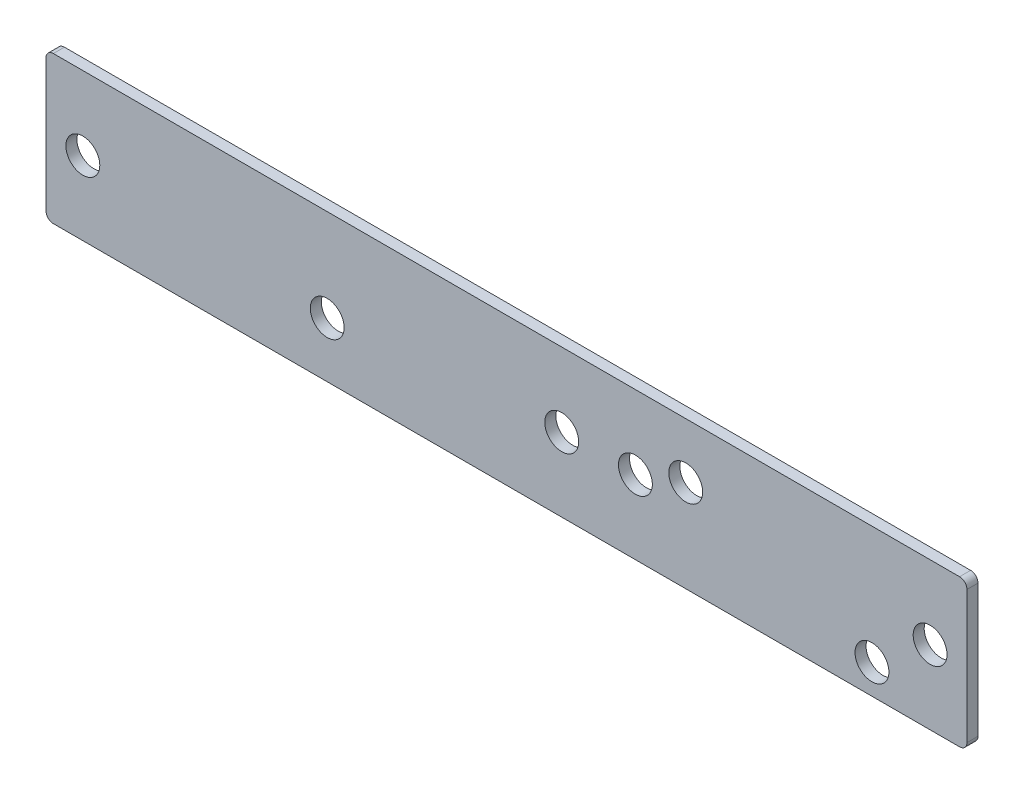
ISO-10303-21;
HEADER;
FILE_DESCRIPTION(('STEP AP214'),'2;1');
FILE_NAME('part.step','',(''),(''),'','','');
FILE_SCHEMA(('AUTOMOTIVE_DESIGN { 1 0 10303 214 1 1 1 1 }'));
ENDSEC;
DATA;
#1=APPLICATION_CONTEXT('core data for automotive mechanical design processes');
#2=APPLICATION_PROTOCOL_DEFINITION('international standard','automotive_design',2000,#1);
#3=PRODUCT_CONTEXT('',#1,'mechanical');
#4=PRODUCT('Part','Part','',(#3));
#5=PRODUCT_RELATED_PRODUCT_CATEGORY('part','',(#4));
#6=PRODUCT_DEFINITION_FORMATION('','',#4);
#7=PRODUCT_DEFINITION_CONTEXT('part definition',#1,'design');
#8=PRODUCT_DEFINITION('design','',#6,#7);
#9=PRODUCT_DEFINITION_SHAPE('','',#8);
#10=(LENGTH_UNIT() NAMED_UNIT(*) SI_UNIT(.MILLI.,.METRE.));
#11=(NAMED_UNIT(*) PLANE_ANGLE_UNIT() SI_UNIT($,.RADIAN.));
#12=(NAMED_UNIT(*) SI_UNIT($,.STERADIAN.) SOLID_ANGLE_UNIT());
#13=UNCERTAINTY_MEASURE_WITH_UNIT(LENGTH_MEASURE(1.E-05),#10,'distance_accuracy_value','');
#14=(GEOMETRIC_REPRESENTATION_CONTEXT(3) GLOBAL_UNCERTAINTY_ASSIGNED_CONTEXT((#13)) GLOBAL_UNIT_ASSIGNED_CONTEXT((#10,
#11,#12)) REPRESENTATION_CONTEXT('',''));
#15=CARTESIAN_POINT('',(0.,0.,0.));
#16=DIRECTION('',(0.,0.,1.));
#17=DIRECTION('',(1.,0.,0.));
#18=AXIS2_PLACEMENT_3D('',#15,#16,#17);
#19=CARTESIAN_POINT('',(-125.,20.,3.));
#20=DIRECTION('',(1.,0.,0.));
#21=DIRECTION('',(0.,1.,0.));
#22=AXIS2_PLACEMENT_3D('',#19,#20,#21);
#23=PLANE('',#22);
#24=DIRECTION('',(0.,-1.,0.));
#25=VECTOR('',#24,1.);
#26=CARTESIAN_POINT('',(-125.,20.,0.));
#27=LINE('',#26,#25);
#28=CARTESIAN_POINT('',(-125.,18.,0.));
#29=VERTEX_POINT('',#28);
#30=CARTESIAN_POINT('',(-125.,-18.,0.));
#31=VERTEX_POINT('',#30);
#32=EDGE_CURVE('E113',#29,#31,#27,.T.);
#33=ORIENTED_EDGE('',*,*,#32,.T.);
#34=DIRECTION('',(0.,0.,-1.));
#35=VECTOR('',#34,1.);
#36=CARTESIAN_POINT('',(-125.,-18.,3.));
#37=LINE('',#36,#35);
#38=CARTESIAN_POINT('',(-125.,-18.,3.));
#39=VERTEX_POINT('',#38);
#40=EDGE_CURVE('E90',#31,#39,#37,.F.);
#41=ORIENTED_EDGE('',*,*,#40,.T.);
#42=DIRECTION('',(0.,-1.,0.));
#43=VECTOR('',#42,1.);
#44=CARTESIAN_POINT('',(-125.,20.,3.));
#45=LINE('',#44,#43);
#46=CARTESIAN_POINT('',(-125.,18.,3.));
#47=VERTEX_POINT('',#46);
#48=EDGE_CURVE('E123',#47,#39,#45,.T.);
#49=ORIENTED_EDGE('',*,*,#48,.F.);
#50=DIRECTION('',(0.,0.,-1.));
#51=VECTOR('',#50,1.);
#52=CARTESIAN_POINT('',(-125.,18.,3.));
#53=LINE('',#52,#51);
#54=EDGE_CURVE('E95',#47,#29,#53,.T.);
#55=ORIENTED_EDGE('',*,*,#54,.T.);
#56=EDGE_LOOP('',(#33,#41,#49,#55));
#57=FACE_BOUND('',#56,.T.);
#58=ADVANCED_FACE('F16',(#57),#23,.F.);
#59=CARTESIAN_POINT('',(-125.,-20.,3.));
#60=DIRECTION('',(0.,1.,0.));
#61=DIRECTION('',(-1.,0.,0.));
#62=AXIS2_PLACEMENT_3D('',#59,#60,#61);
#63=PLANE('',#62);
#64=DIRECTION('',(1.,0.,0.));
#65=VECTOR('',#64,1.);
#66=CARTESIAN_POINT('',(-125.,-20.,3.));
#67=LINE('',#66,#65);
#68=CARTESIAN_POINT('',(-123.,-20.,3.));
#69=VERTEX_POINT('',#68);
#70=CARTESIAN_POINT('',(123.,-19.9999999999999,3.));
#71=VERTEX_POINT('',#70);
#72=EDGE_CURVE('E105',#69,#71,#67,.T.);
#73=ORIENTED_EDGE('',*,*,#72,.F.);
#74=DIRECTION('',(0.,0.,-1.));
#75=VECTOR('',#74,1.);
#76=CARTESIAN_POINT('',(-123.,-20.,3.));
#77=LINE('',#76,#75);
#78=CARTESIAN_POINT('',(-123.,-20.,0.));
#79=VERTEX_POINT('',#78);
#80=EDGE_CURVE('E89',#69,#79,#77,.T.);
#81=ORIENTED_EDGE('',*,*,#80,.T.);
#82=DIRECTION('',(1.,0.,0.));
#83=VECTOR('',#82,1.);
#84=CARTESIAN_POINT('',(-125.,-20.,0.));
#85=LINE('',#84,#83);
#86=CARTESIAN_POINT('',(123.,-19.9999999999999,0.));
#87=VERTEX_POINT('',#86);
#88=EDGE_CURVE('E102',#79,#87,#85,.T.);
#89=ORIENTED_EDGE('',*,*,#88,.T.);
#90=DIRECTION('',(0.,0.,-1.));
#91=VECTOR('',#90,1.);
#92=CARTESIAN_POINT('',(123.,-19.9999999999999,3.));
#93=LINE('',#92,#91);
#94=EDGE_CURVE('E107',#87,#71,#93,.F.);
#95=ORIENTED_EDGE('',*,*,#94,.T.);
#96=EDGE_LOOP('',(#73,#81,#89,#95));
#97=FACE_BOUND('',#96,.T.);
#98=ADVANCED_FACE('F101',(#97),#63,.F.);
#99=CARTESIAN_POINT('',(125.,20.,3.));
#100=DIRECTION('',(-1.,0.,0.));
#101=DIRECTION('',(0.,0.,1.));
#102=AXIS2_PLACEMENT_3D('',#99,#100,#101);
#103=PLANE('',#102);
#104=DIRECTION('',(0.,1.,0.));
#105=VECTOR('',#104,1.);
#106=CARTESIAN_POINT('',(125.,20.,3.));
#107=LINE('',#106,#105);
#108=CARTESIAN_POINT('',(125.,-17.9999999999999,3.));
#109=VERTEX_POINT('',#108);
#110=CARTESIAN_POINT('',(125.,18.,3.));
#111=VERTEX_POINT('',#110);
#112=EDGE_CURVE('E186',#109,#111,#107,.T.);
#113=ORIENTED_EDGE('',*,*,#112,.F.);
#114=DIRECTION('',(0.,0.,-1.));
#115=VECTOR('',#114,1.);
#116=CARTESIAN_POINT('',(125.,-17.9999999999999,3.));
#117=LINE('',#116,#115);
#118=CARTESIAN_POINT('',(125.,-17.9999999999999,0.));
#119=VERTEX_POINT('',#118);
#120=EDGE_CURVE('E10',#109,#119,#117,.T.);
#121=ORIENTED_EDGE('',*,*,#120,.T.);
#122=DIRECTION('',(0.,1.,0.));
#123=VECTOR('',#122,1.);
#124=CARTESIAN_POINT('',(125.,20.,0.));
#125=LINE('',#124,#123);
#126=CARTESIAN_POINT('',(125.,18.,0.));
#127=VERTEX_POINT('',#126);
#128=EDGE_CURVE('E112',#119,#127,#125,.T.);
#129=ORIENTED_EDGE('',*,*,#128,.T.);
#130=DIRECTION('',(0.,0.,-1.));
#131=VECTOR('',#130,1.);
#132=CARTESIAN_POINT('',(125.,18.,3.));
#133=LINE('',#132,#131);
#134=EDGE_CURVE('E25',#127,#111,#133,.F.);
#135=ORIENTED_EDGE('',*,*,#134,.T.);
#136=EDGE_LOOP('',(#113,#121,#129,#135));
#137=FACE_BOUND('',#136,.T.);
#138=ADVANCED_FACE('F201',(#137),#103,.F.);
#139=CARTESIAN_POINT('',(-125.,20.,3.));
#140=DIRECTION('',(0.,-1.,0.));
#141=DIRECTION('',(0.,0.,-1.));
#142=AXIS2_PLACEMENT_3D('',#139,#140,#141);
#143=PLANE('',#142);
#144=DIRECTION('',(-1.,0.,0.));
#145=VECTOR('',#144,1.);
#146=CARTESIAN_POINT('',(-125.,20.,0.));
#147=LINE('',#146,#145);
#148=CARTESIAN_POINT('',(123.,20.,0.));
#149=VERTEX_POINT('',#148);
#150=CARTESIAN_POINT('',(-123.,20.,0.));
#151=VERTEX_POINT('',#150);
#152=EDGE_CURVE('E116',#149,#151,#147,.T.);
#153=ORIENTED_EDGE('',*,*,#152,.T.);
#154=DIRECTION('',(0.,0.,-1.));
#155=VECTOR('',#154,1.);
#156=CARTESIAN_POINT('',(-123.,20.,3.));
#157=LINE('',#156,#155);
#158=CARTESIAN_POINT('',(-123.,20.,3.));
#159=VERTEX_POINT('',#158);
#160=EDGE_CURVE('E33',#151,#159,#157,.F.);
#161=ORIENTED_EDGE('',*,*,#160,.T.);
#162=DIRECTION('',(-1.,0.,0.));
#163=VECTOR('',#162,1.);
#164=CARTESIAN_POINT('',(-125.,20.,3.));
#165=LINE('',#164,#163);
#166=CARTESIAN_POINT('',(123.,20.,3.));
#167=VERTEX_POINT('',#166);
#168=EDGE_CURVE('E124',#167,#159,#165,.T.);
#169=ORIENTED_EDGE('',*,*,#168,.F.);
#170=DIRECTION('',(0.,0.,-1.));
#171=VECTOR('',#170,1.);
#172=CARTESIAN_POINT('',(123.,20.,3.));
#173=LINE('',#172,#171);
#174=EDGE_CURVE('E139',#167,#149,#173,.T.);
#175=ORIENTED_EDGE('',*,*,#174,.T.);
#176=EDGE_LOOP('',(#153,#161,#169,#175));
#177=FACE_BOUND('',#176,.T.);
#178=ADVANCED_FACE('F196',(#177),#143,.F.);
#179=CARTESIAN_POINT('',(0.,0.,3.));
#180=DIRECTION('',(0.,0.,1.));
#181=DIRECTION('',(1.,0.,0.));
#182=AXIS2_PLACEMENT_3D('',#179,#180,#181);
#183=PLANE('',#182);
#184=CARTESIAN_POINT('',(15.,0.,3.));
#185=DIRECTION('',(0.,0.,1.));
#186=DIRECTION('',(1.,0.,0.));
#187=AXIS2_PLACEMENT_3D('',#184,#185,#186);
#188=CIRCLE('',#187,4.6);
#189=CARTESIAN_POINT('',(19.6,0.,3.));
#190=VERTEX_POINT('',#189);
#191=EDGE_CURVE('E152',#190,#190,#188,.T.);
#192=ORIENTED_EDGE('',*,*,#191,.F.);
#193=EDGE_LOOP('',(#192));
#194=FACE_BOUND('',#193,.T.);
#195=CARTESIAN_POINT('',(35.,0.,3.));
#196=DIRECTION('',(0.,0.,1.));
#197=DIRECTION('',(1.,0.,0.));
#198=AXIS2_PLACEMENT_3D('',#195,#196,#197);
#199=CIRCLE('',#198,4.6);
#200=CARTESIAN_POINT('',(39.6,0.,3.));
#201=VERTEX_POINT('',#200);
#202=EDGE_CURVE('E355',#201,#201,#199,.T.);
#203=ORIENTED_EDGE('',*,*,#202,.F.);
#204=EDGE_LOOP('',(#203));
#205=FACE_BOUND('',#204,.T.);
#206=CARTESIAN_POINT('',(115.,0.,3.));
#207=DIRECTION('',(0.,0.,1.));
#208=DIRECTION('',(1.,0.,0.));
#209=AXIS2_PLACEMENT_3D('',#206,#207,#208);
#210=CIRCLE('',#209,4.60000000000001);
#211=CARTESIAN_POINT('',(119.6,0.,3.));
#212=VERTEX_POINT('',#211);
#213=EDGE_CURVE('E165',#212,#212,#210,.T.);
#214=ORIENTED_EDGE('',*,*,#213,.F.);
#215=EDGE_LOOP('',(#214));
#216=FACE_BOUND('',#215,.T.);
#217=CARTESIAN_POINT('',(-115.,0.,3.));
#218=DIRECTION('',(0.,0.,1.));
#219=DIRECTION('',(1.,0.,0.));
#220=AXIS2_PLACEMENT_3D('',#217,#218,#219);
#221=CIRCLE('',#220,4.6);
#222=CARTESIAN_POINT('',(-110.4,0.,3.));
#223=VERTEX_POINT('',#222);
#224=EDGE_CURVE('E148',#223,#223,#221,.T.);
#225=ORIENTED_EDGE('',*,*,#224,.F.);
#226=EDGE_LOOP('',(#225));
#227=FACE_BOUND('',#226,.T.);
#228=CARTESIAN_POINT('',(48.6602540378265,4.99999999999998,3.));
#229=DIRECTION('',(0.,0.,1.));
#230=DIRECTION('',(1.,0.,0.));
#231=AXIS2_PLACEMENT_3D('',#228,#229,#230);
#232=CIRCLE('',#231,4.6);
#233=CARTESIAN_POINT('',(53.2602540378265,4.99999999999998,3.));
#234=VERTEX_POINT('',#233);
#235=EDGE_CURVE('E167',#234,#234,#232,.T.);
#236=ORIENTED_EDGE('',*,*,#235,.F.);
#237=EDGE_LOOP('',(#236));
#238=FACE_BOUND('',#237,.T.);
#239=CARTESIAN_POINT('',(99.2153903091556,-12.,3.));
#240=DIRECTION('',(0.,0.,1.));
#241=DIRECTION('',(1.,0.,0.));
#242=AXIS2_PLACEMENT_3D('',#239,#240,#241);
#243=CIRCLE('',#242,4.6);
#244=CARTESIAN_POINT('',(103.815390309156,-12.,3.));
#245=VERTEX_POINT('',#244);
#246=EDGE_CURVE('E147',#245,#245,#243,.T.);
#247=ORIENTED_EDGE('',*,*,#246,.F.);
#248=EDGE_LOOP('',(#247));
#249=FACE_BOUND('',#248,.T.);
#250=CARTESIAN_POINT('',(-48.6602540378623,-5.00000000000002,3.));
#251=DIRECTION('',(0.,0.,1.));
#252=DIRECTION('',(1.,0.,0.));
#253=AXIS2_PLACEMENT_3D('',#250,#251,#252);
#254=CIRCLE('',#253,4.6);
#255=CARTESIAN_POINT('',(-44.0602540378623,-5.00000000000002,3.));
#256=VERTEX_POINT('',#255);
#257=EDGE_CURVE('E174',#256,#256,#254,.T.);
#258=ORIENTED_EDGE('',*,*,#257,.F.);
#259=EDGE_LOOP('',(#258));
#260=FACE_BOUND('',#259,.T.);
#261=ORIENTED_EDGE('',*,*,#48,.T.);
#262=CARTESIAN_POINT('',(-123.,-18.,3.));
#263=DIRECTION('',(0.,0.,1.));
#264=DIRECTION('',(1.,0.,0.));
#265=AXIS2_PLACEMENT_3D('',#262,#263,#264);
#266=CIRCLE('',#265,2.);
#267=EDGE_CURVE('E137',#39,#69,#266,.T.);
#268=ORIENTED_EDGE('',*,*,#267,.T.);
#269=ORIENTED_EDGE('',*,*,#72,.T.);
#270=CARTESIAN_POINT('',(123.,-17.9999999999999,3.));
#271=DIRECTION('',(0.,0.,1.));
#272=DIRECTION('',(1.,0.,0.));
#273=AXIS2_PLACEMENT_3D('',#270,#271,#272);
#274=CIRCLE('',#273,2.);
#275=EDGE_CURVE('E133',#71,#109,#274,.T.);
#276=ORIENTED_EDGE('',*,*,#275,.T.);
#277=ORIENTED_EDGE('',*,*,#112,.T.);
#278=CARTESIAN_POINT('',(123.,18.,3.));
#279=DIRECTION('',(0.,0.,1.));
#280=DIRECTION('',(1.,0.,0.));
#281=AXIS2_PLACEMENT_3D('',#278,#279,#280);
#282=CIRCLE('',#281,2.);
#283=EDGE_CURVE('E40',#111,#167,#282,.T.);
#284=ORIENTED_EDGE('',*,*,#283,.T.);
#285=ORIENTED_EDGE('',*,*,#168,.T.);
#286=CARTESIAN_POINT('',(-123.,18.,3.));
#287=DIRECTION('',(0.,0.,1.));
#288=DIRECTION('',(1.,0.,0.));
#289=AXIS2_PLACEMENT_3D('',#286,#287,#288);
#290=CIRCLE('',#289,2.);
#291=EDGE_CURVE('E135',#159,#47,#290,.T.);
#292=ORIENTED_EDGE('',*,*,#291,.T.);
#293=EDGE_LOOP('',(#261,#268,#269,#276,#277,#284,#285,#292));
#294=FACE_BOUND('',#293,.T.);
#295=ADVANCED_FACE('F188',(#194,#205,#216,#227,#238,#249,#260,#294),#183,.T.);
#296=CARTESIAN_POINT('',(0.,0.,0.));
#297=DIRECTION('',(0.,0.,1.));
#298=DIRECTION('',(1.,0.,0.));
#299=AXIS2_PLACEMENT_3D('',#296,#297,#298);
#300=PLANE('',#299);
#301=CARTESIAN_POINT('',(15.,0.,0.));
#302=DIRECTION('',(0.,0.,1.));
#303=DIRECTION('',(1.,0.,0.));
#304=AXIS2_PLACEMENT_3D('',#301,#302,#303);
#305=CIRCLE('',#304,4.6);
#306=CARTESIAN_POINT('',(19.6,0.,0.));
#307=VERTEX_POINT('',#306);
#308=EDGE_CURVE('E20',#307,#307,#305,.T.);
#309=ORIENTED_EDGE('',*,*,#308,.T.);
#310=EDGE_LOOP('',(#309));
#311=FACE_BOUND('',#310,.T.);
#312=CARTESIAN_POINT('',(35.,0.,0.));
#313=DIRECTION('',(0.,0.,1.));
#314=DIRECTION('',(1.,0.,0.));
#315=AXIS2_PLACEMENT_3D('',#312,#313,#314);
#316=CIRCLE('',#315,4.6);
#317=CARTESIAN_POINT('',(39.6,0.,0.));
#318=VERTEX_POINT('',#317);
#319=EDGE_CURVE('E151',#318,#318,#316,.T.);
#320=ORIENTED_EDGE('',*,*,#319,.T.);
#321=EDGE_LOOP('',(#320));
#322=FACE_BOUND('',#321,.T.);
#323=CARTESIAN_POINT('',(115.,0.,0.));
#324=DIRECTION('',(0.,0.,1.));
#325=DIRECTION('',(1.,0.,0.));
#326=AXIS2_PLACEMENT_3D('',#323,#324,#325);
#327=CIRCLE('',#326,4.60000000000001);
#328=CARTESIAN_POINT('',(119.6,0.,0.));
#329=VERTEX_POINT('',#328);
#330=EDGE_CURVE('E149',#329,#329,#327,.T.);
#331=ORIENTED_EDGE('',*,*,#330,.T.);
#332=EDGE_LOOP('',(#331));
#333=FACE_BOUND('',#332,.T.);
#334=CARTESIAN_POINT('',(-115.,0.,0.));
#335=DIRECTION('',(0.,0.,1.));
#336=DIRECTION('',(1.,0.,0.));
#337=AXIS2_PLACEMENT_3D('',#334,#335,#336);
#338=CIRCLE('',#337,4.6);
#339=CARTESIAN_POINT('',(-110.4,0.,0.));
#340=VERTEX_POINT('',#339);
#341=EDGE_CURVE('E144',#340,#340,#338,.T.);
#342=ORIENTED_EDGE('',*,*,#341,.T.);
#343=EDGE_LOOP('',(#342));
#344=FACE_BOUND('',#343,.T.);
#345=CARTESIAN_POINT('',(48.6602540378265,4.99999999999998,0.));
#346=DIRECTION('',(0.,0.,1.));
#347=DIRECTION('',(1.,0.,0.));
#348=AXIS2_PLACEMENT_3D('',#345,#346,#347);
#349=CIRCLE('',#348,4.6);
#350=CARTESIAN_POINT('',(53.2602540378265,4.99999999999998,0.));
#351=VERTEX_POINT('',#350);
#352=EDGE_CURVE('E170',#351,#351,#349,.F.);
#353=ORIENTED_EDGE('',*,*,#352,.F.);
#354=EDGE_LOOP('',(#353));
#355=FACE_BOUND('',#354,.T.);
#356=CARTESIAN_POINT('',(99.2153903091556,-12.,0.));
#357=DIRECTION('',(0.,0.,1.));
#358=DIRECTION('',(1.,0.,0.));
#359=AXIS2_PLACEMENT_3D('',#356,#357,#358);
#360=CIRCLE('',#359,4.6);
#361=CARTESIAN_POINT('',(103.815390309156,-12.,0.));
#362=VERTEX_POINT('',#361);
#363=EDGE_CURVE('E171',#362,#362,#360,.F.);
#364=ORIENTED_EDGE('',*,*,#363,.F.);
#365=EDGE_LOOP('',(#364));
#366=FACE_BOUND('',#365,.T.);
#367=CARTESIAN_POINT('',(-48.6602540378623,-5.00000000000002,0.));
#368=DIRECTION('',(0.,0.,1.));
#369=DIRECTION('',(1.,0.,0.));
#370=AXIS2_PLACEMENT_3D('',#367,#368,#369);
#371=CIRCLE('',#370,4.6);
#372=CARTESIAN_POINT('',(-44.0602540378623,-5.00000000000002,0.));
#373=VERTEX_POINT('',#372);
#374=EDGE_CURVE('E118',#373,#373,#371,.F.);
#375=ORIENTED_EDGE('',*,*,#374,.F.);
#376=EDGE_LOOP('',(#375));
#377=FACE_BOUND('',#376,.T.);
#378=ORIENTED_EDGE('',*,*,#88,.F.);
#379=CARTESIAN_POINT('',(-123.,-18.,0.));
#380=DIRECTION('',(0.,0.,1.));
#381=DIRECTION('',(1.,0.,0.));
#382=AXIS2_PLACEMENT_3D('',#379,#380,#381);
#383=CIRCLE('',#382,2.);
#384=EDGE_CURVE('E85',#79,#31,#383,.F.);
#385=ORIENTED_EDGE('',*,*,#384,.T.);
#386=ORIENTED_EDGE('',*,*,#32,.F.);
#387=CARTESIAN_POINT('',(-123.,18.,0.));
#388=DIRECTION('',(0.,0.,1.));
#389=DIRECTION('',(1.,0.,0.));
#390=AXIS2_PLACEMENT_3D('',#387,#388,#389);
#391=CIRCLE('',#390,2.);
#392=EDGE_CURVE('E96',#29,#151,#391,.F.);
#393=ORIENTED_EDGE('',*,*,#392,.T.);
#394=ORIENTED_EDGE('',*,*,#152,.F.);
#395=CARTESIAN_POINT('',(123.,18.,0.));
#396=DIRECTION('',(0.,0.,1.));
#397=DIRECTION('',(1.,0.,0.));
#398=AXIS2_PLACEMENT_3D('',#395,#396,#397);
#399=CIRCLE('',#398,2.);
#400=EDGE_CURVE('E106',#149,#127,#399,.F.);
#401=ORIENTED_EDGE('',*,*,#400,.T.);
#402=ORIENTED_EDGE('',*,*,#128,.F.);
#403=CARTESIAN_POINT('',(123.,-17.9999999999999,0.));
#404=DIRECTION('',(0.,0.,1.));
#405=DIRECTION('',(1.,0.,0.));
#406=AXIS2_PLACEMENT_3D('',#403,#404,#405);
#407=CIRCLE('',#406,2.);
#408=EDGE_CURVE('E111',#119,#87,#407,.F.);
#409=ORIENTED_EDGE('',*,*,#408,.T.);
#410=EDGE_LOOP('',(#378,#385,#386,#393,#394,#401,#402,#409));
#411=FACE_BOUND('',#410,.T.);
#412=ADVANCED_FACE('F109',(#311,#322,#333,#344,#355,#366,#377,#411),#300,.F.);
#413=CARTESIAN_POINT('',(-48.6602540378623,-5.00000000000002,-13.0107647738325));
#414=DIRECTION('',(0.,0.,1.));
#415=DIRECTION('',(1.,0.,0.));
#416=AXIS2_PLACEMENT_3D('',#413,#414,#415);
#417=CYLINDRICAL_SURFACE('',#416,4.6);
#418=ORIENTED_EDGE('',*,*,#374,.T.);
#419=EDGE_LOOP('',(#418));
#420=FACE_BOUND('',#419,.T.);
#421=ORIENTED_EDGE('',*,*,#257,.T.);
#422=EDGE_LOOP('',(#421));
#423=FACE_BOUND('',#422,.T.);
#424=ADVANCED_FACE('F233',(#420,#423),#417,.F.);
#425=CARTESIAN_POINT('',(99.2153903091556,-12.,-13.0107647738325));
#426=DIRECTION('',(0.,0.,1.));
#427=DIRECTION('',(1.,0.,0.));
#428=AXIS2_PLACEMENT_3D('',#425,#426,#427);
#429=CYLINDRICAL_SURFACE('',#428,4.6);
#430=ORIENTED_EDGE('',*,*,#363,.T.);
#431=EDGE_LOOP('',(#430));
#432=FACE_BOUND('',#431,.T.);
#433=ORIENTED_EDGE('',*,*,#246,.T.);
#434=EDGE_LOOP('',(#433));
#435=FACE_BOUND('',#434,.T.);
#436=ADVANCED_FACE('F227',(#432,#435),#429,.F.);
#437=CARTESIAN_POINT('',(48.6602540378265,4.99999999999998,-13.0107647738325));
#438=DIRECTION('',(0.,0.,1.));
#439=DIRECTION('',(1.,0.,0.));
#440=AXIS2_PLACEMENT_3D('',#437,#438,#439);
#441=CYLINDRICAL_SURFACE('',#440,4.6);
#442=ORIENTED_EDGE('',*,*,#352,.T.);
#443=EDGE_LOOP('',(#442));
#444=FACE_BOUND('',#443,.T.);
#445=ORIENTED_EDGE('',*,*,#235,.T.);
#446=EDGE_LOOP('',(#445));
#447=FACE_BOUND('',#446,.T.);
#448=ADVANCED_FACE('F223',(#444,#447),#441,.F.);
#449=CARTESIAN_POINT('',(-123.,-18.,3.));
#450=DIRECTION('',(0.,0.,-1.));
#451=DIRECTION('',(-1.,0.,0.));
#452=AXIS2_PLACEMENT_3D('',#449,#450,#451);
#453=CYLINDRICAL_SURFACE('',#452,2.);
#454=ORIENTED_EDGE('',*,*,#267,.F.);
#455=ORIENTED_EDGE('',*,*,#40,.F.);
#456=ORIENTED_EDGE('',*,*,#384,.F.);
#457=ORIENTED_EDGE('',*,*,#80,.F.);
#458=EDGE_LOOP('',(#454,#455,#456,#457));
#459=FACE_BOUND('',#458,.T.);
#460=ADVANCED_FACE('F88',(#459),#453,.T.);
#461=CARTESIAN_POINT('',(-123.,18.,3.));
#462=DIRECTION('',(0.,0.,-1.));
#463=DIRECTION('',(-1.,0.,0.));
#464=AXIS2_PLACEMENT_3D('',#461,#462,#463);
#465=CYLINDRICAL_SURFACE('',#464,2.);
#466=ORIENTED_EDGE('',*,*,#291,.F.);
#467=ORIENTED_EDGE('',*,*,#160,.F.);
#468=ORIENTED_EDGE('',*,*,#392,.F.);
#469=ORIENTED_EDGE('',*,*,#54,.F.);
#470=EDGE_LOOP('',(#466,#467,#468,#469));
#471=FACE_BOUND('',#470,.T.);
#472=ADVANCED_FACE('F193',(#471),#465,.T.);
#473=CARTESIAN_POINT('',(123.,-17.9999999999999,3.));
#474=DIRECTION('',(0.,0.,-1.));
#475=DIRECTION('',(-1.,0.,0.));
#476=AXIS2_PLACEMENT_3D('',#473,#474,#475);
#477=CYLINDRICAL_SURFACE('',#476,2.);
#478=ORIENTED_EDGE('',*,*,#275,.F.);
#479=ORIENTED_EDGE('',*,*,#94,.F.);
#480=ORIENTED_EDGE('',*,*,#408,.F.);
#481=ORIENTED_EDGE('',*,*,#120,.F.);
#482=EDGE_LOOP('',(#478,#479,#480,#481));
#483=FACE_BOUND('',#482,.T.);
#484=ADVANCED_FACE('F205',(#483),#477,.T.);
#485=CARTESIAN_POINT('',(123.,18.,3.));
#486=DIRECTION('',(0.,0.,-1.));
#487=DIRECTION('',(-1.,0.,0.));
#488=AXIS2_PLACEMENT_3D('',#485,#486,#487);
#489=CYLINDRICAL_SURFACE('',#488,2.);
#490=ORIENTED_EDGE('',*,*,#283,.F.);
#491=ORIENTED_EDGE('',*,*,#134,.F.);
#492=ORIENTED_EDGE('',*,*,#400,.F.);
#493=ORIENTED_EDGE('',*,*,#174,.F.);
#494=EDGE_LOOP('',(#490,#491,#492,#493));
#495=FACE_BOUND('',#494,.T.);
#496=ADVANCED_FACE('F18',(#495),#489,.T.);
#497=CARTESIAN_POINT('',(-115.,0.,-7.));
#498=DIRECTION('',(0.,0.,1.));
#499=DIRECTION('',(1.,0.,0.));
#500=AXIS2_PLACEMENT_3D('',#497,#498,#499);
#501=CYLINDRICAL_SURFACE('',#500,4.6);
#502=ORIENTED_EDGE('',*,*,#224,.T.);
#503=EDGE_LOOP('',(#502));
#504=FACE_BOUND('',#503,.T.);
#505=ORIENTED_EDGE('',*,*,#341,.F.);
#506=EDGE_LOOP('',(#505));
#507=FACE_BOUND('',#506,.T.);
#508=ADVANCED_FACE('F212',(#504,#507),#501,.F.);
#509=CARTESIAN_POINT('',(115.,0.,-7.));
#510=DIRECTION('',(0.,0.,1.));
#511=DIRECTION('',(1.,0.,0.));
#512=AXIS2_PLACEMENT_3D('',#509,#510,#511);
#513=CYLINDRICAL_SURFACE('',#512,4.60000000000001);
#514=ORIENTED_EDGE('',*,*,#213,.T.);
#515=EDGE_LOOP('',(#514));
#516=FACE_BOUND('',#515,.T.);
#517=ORIENTED_EDGE('',*,*,#330,.F.);
#518=EDGE_LOOP('',(#517));
#519=FACE_BOUND('',#518,.T.);
#520=ADVANCED_FACE('F320',(#516,#519),#513,.F.);
#521=CARTESIAN_POINT('',(35.,0.,-7.));
#522=DIRECTION('',(0.,0.,1.));
#523=DIRECTION('',(1.,0.,0.));
#524=AXIS2_PLACEMENT_3D('',#521,#522,#523);
#525=CYLINDRICAL_SURFACE('',#524,4.6);
#526=ORIENTED_EDGE('',*,*,#202,.T.);
#527=EDGE_LOOP('',(#526));
#528=FACE_BOUND('',#527,.T.);
#529=ORIENTED_EDGE('',*,*,#319,.F.);
#530=EDGE_LOOP('',(#529));
#531=FACE_BOUND('',#530,.T.);
#532=ADVANCED_FACE('F328',(#528,#531),#525,.F.);
#533=CARTESIAN_POINT('',(15.,0.,-7.));
#534=DIRECTION('',(0.,0.,1.));
#535=DIRECTION('',(1.,0.,0.));
#536=AXIS2_PLACEMENT_3D('',#533,#534,#535);
#537=CYLINDRICAL_SURFACE('',#536,4.6);
#538=ORIENTED_EDGE('',*,*,#191,.T.);
#539=EDGE_LOOP('',(#538));
#540=FACE_BOUND('',#539,.T.);
#541=ORIENTED_EDGE('',*,*,#308,.F.);
#542=EDGE_LOOP('',(#541));
#543=FACE_BOUND('',#542,.T.);
#544=ADVANCED_FACE('F337',(#540,#543),#537,.F.);
#545=CLOSED_SHELL('',(#58,#98,#138,#178,#295,#412,#424,#436,#448,#460,#472,#484,#496,#508,#520,
#532,#544));
#546=MANIFOLD_SOLID_BREP('B1',#545);
#547=ADVANCED_BREP_SHAPE_REPRESENTATION('',(#18,#546),#14);
#548=SHAPE_DEFINITION_REPRESENTATION(#9,#547);
ENDSEC;
END-ISO-10303-21;
